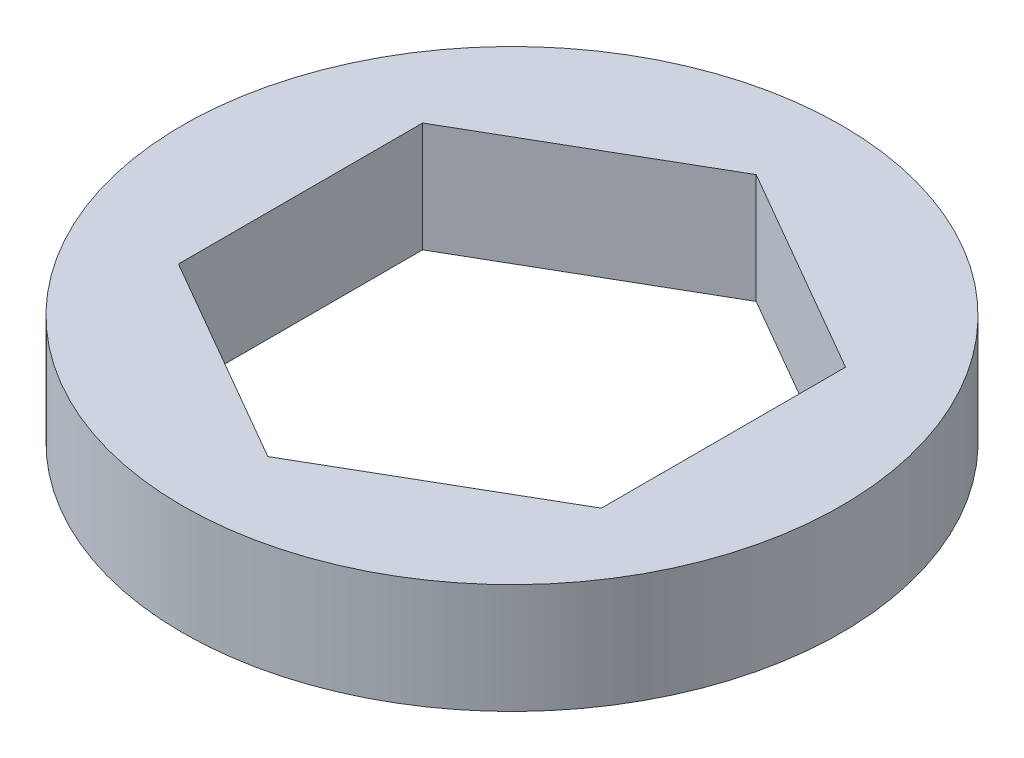
ISO-10303-21;
HEADER;
FILE_DESCRIPTION(('STEP AP214'),'2;1');
FILE_NAME('part.step','',(''),(''),'','','');
FILE_SCHEMA(('AUTOMOTIVE_DESIGN { 1 0 10303 214 1 1 1 1 }'));
ENDSEC;
DATA;
#1=APPLICATION_CONTEXT('core data for automotive mechanical design processes');
#2=APPLICATION_PROTOCOL_DEFINITION('international standard','automotive_design',2000,#1);
#3=PRODUCT_CONTEXT('',#1,'mechanical');
#4=PRODUCT('Part','Part','',(#3));
#5=PRODUCT_RELATED_PRODUCT_CATEGORY('part','',(#4));
#6=PRODUCT_DEFINITION_FORMATION('','',#4);
#7=PRODUCT_DEFINITION_CONTEXT('part definition',#1,'design');
#8=PRODUCT_DEFINITION('design','',#6,#7);
#9=PRODUCT_DEFINITION_SHAPE('','',#8);
#10=(LENGTH_UNIT() NAMED_UNIT(*) SI_UNIT(.MILLI.,.METRE.));
#11=(NAMED_UNIT(*) PLANE_ANGLE_UNIT() SI_UNIT($,.RADIAN.));
#12=(NAMED_UNIT(*) SI_UNIT($,.STERADIAN.) SOLID_ANGLE_UNIT());
#13=UNCERTAINTY_MEASURE_WITH_UNIT(LENGTH_MEASURE(1.E-05),#10,'distance_accuracy_value','');
#14=(GEOMETRIC_REPRESENTATION_CONTEXT(3) GLOBAL_UNCERTAINTY_ASSIGNED_CONTEXT((#13)) GLOBAL_UNIT_ASSIGNED_CONTEXT((#10,
#11,#12)) REPRESENTATION_CONTEXT('',''));
#15=CARTESIAN_POINT('',(0.,0.,0.));
#16=DIRECTION('',(0.,0.,1.));
#17=DIRECTION('',(1.,0.,0.));
#18=AXIS2_PLACEMENT_3D('',#15,#16,#17);
#19=CARTESIAN_POINT('',(0.,1.27,0.));
#20=DIRECTION('',(0.,1.,0.));
#21=DIRECTION('',(0.,0.,1.));
#22=AXIS2_PLACEMENT_3D('',#19,#20,#21);
#23=PLANE('',#22);
#24=CARTESIAN_POINT('',(0.,1.27,0.));
#25=DIRECTION('',(0.,1.,0.));
#26=DIRECTION('',(0.,0.,1.));
#27=AXIS2_PLACEMENT_3D('',#24,#25,#26);
#28=CIRCLE('',#27,7.62);
#29=CARTESIAN_POINT('',(0.,1.27,7.62));
#30=VERTEX_POINT('',#29);
#31=EDGE_CURVE('E11',#30,#30,#28,.T.);
#32=ORIENTED_EDGE('',*,*,#31,.T.);
#33=EDGE_LOOP('',(#32));
#34=FACE_BOUND('',#33,.T.);
#35=DIRECTION('',(0.,0.,-1.));
#36=VECTOR('',#35,1.);
#37=CARTESIAN_POINT('',(4.8895,1.27,2.82295414120268));
#38=LINE('',#37,#36);
#39=CARTESIAN_POINT('',(4.8895,1.27,2.82295414120268));
#40=VERTEX_POINT('',#39);
#41=CARTESIAN_POINT('',(4.8895,1.27,-2.82295414120268));
#42=VERTEX_POINT('',#41);
#43=EDGE_CURVE('E102',#40,#42,#38,.T.);
#44=ORIENTED_EDGE('',*,*,#43,.F.);
#45=DIRECTION('',(0.866025403784439,0.,-0.5));
#46=VECTOR('',#45,1.);
#47=CARTESIAN_POINT('',(0.,1.27,5.64590828240535));
#48=LINE('',#47,#46);
#49=CARTESIAN_POINT('',(0.,1.27,5.64590828240535));
#50=VERTEX_POINT('',#49);
#51=EDGE_CURVE('E93',#50,#40,#48,.T.);
#52=ORIENTED_EDGE('',*,*,#51,.F.);
#53=DIRECTION('',(0.866025403784439,0.,0.5));
#54=VECTOR('',#53,1.);
#55=CARTESIAN_POINT('',(-4.8895,1.27,2.82295414120267));
#56=LINE('',#55,#54);
#57=CARTESIAN_POINT('',(-4.8895,1.27,2.82295414120267));
#58=VERTEX_POINT('',#57);
#59=EDGE_CURVE('E127',#58,#50,#56,.T.);
#60=ORIENTED_EDGE('',*,*,#59,.F.);
#61=DIRECTION('',(0.,0.,1.));
#62=VECTOR('',#61,1.);
#63=CARTESIAN_POINT('',(-4.8895,1.27,-2.82295414120268));
#64=LINE('',#63,#62);
#65=CARTESIAN_POINT('',(-4.8895,1.27,-2.82295414120268));
#66=VERTEX_POINT('',#65);
#67=EDGE_CURVE('E124',#66,#58,#64,.T.);
#68=ORIENTED_EDGE('',*,*,#67,.F.);
#69=DIRECTION('',(-0.866025403784439,0.,0.5));
#70=VECTOR('',#69,1.);
#71=CARTESIAN_POINT('',(0.,1.27,-5.64590828240535));
#72=LINE('',#71,#70);
#73=CARTESIAN_POINT('',(0.,1.27,-5.64590828240535));
#74=VERTEX_POINT('',#73);
#75=EDGE_CURVE('E119',#74,#66,#72,.T.);
#76=ORIENTED_EDGE('',*,*,#75,.F.);
#77=DIRECTION('',(-0.866025403784439,0.,-0.5));
#78=VECTOR('',#77,1.);
#79=CARTESIAN_POINT('',(4.8895,1.27,-2.82295414120268));
#80=LINE('',#79,#78);
#81=EDGE_CURVE('E115',#42,#74,#80,.T.);
#82=ORIENTED_EDGE('',*,*,#81,.F.);
#83=EDGE_LOOP('',(#44,#52,#60,#68,#76,#82));
#84=FACE_BOUND('',#83,.T.);
#85=ADVANCED_FACE('F39',(#34,#84),#23,.T.);
#86=CARTESIAN_POINT('',(0.,-1.27,0.));
#87=DIRECTION('',(0.,1.,0.));
#88=DIRECTION('',(0.,0.,1.));
#89=AXIS2_PLACEMENT_3D('',#86,#87,#88);
#90=PLANE('',#89);
#91=CARTESIAN_POINT('',(0.,-1.27,0.));
#92=DIRECTION('',(0.,1.,0.));
#93=DIRECTION('',(0.,0.,1.));
#94=AXIS2_PLACEMENT_3D('',#91,#92,#93);
#95=CIRCLE('',#94,7.62);
#96=CARTESIAN_POINT('',(0.,-1.27,7.62));
#97=VERTEX_POINT('',#96);
#98=EDGE_CURVE('E43',#97,#97,#95,.T.);
#99=ORIENTED_EDGE('',*,*,#98,.F.);
#100=EDGE_LOOP('',(#99));
#101=FACE_BOUND('',#100,.T.);
#102=DIRECTION('',(0.866025403784439,0.,-0.5));
#103=VECTOR('',#102,1.);
#104=CARTESIAN_POINT('',(0.,-1.27,5.64590828240535));
#105=LINE('',#104,#103);
#106=CARTESIAN_POINT('',(0.,-1.27,5.64590828240535));
#107=VERTEX_POINT('',#106);
#108=CARTESIAN_POINT('',(4.8895,-1.27,2.82295414120268));
#109=VERTEX_POINT('',#108);
#110=EDGE_CURVE('E63',#107,#109,#105,.T.);
#111=ORIENTED_EDGE('',*,*,#110,.T.);
#112=DIRECTION('',(0.,0.,-1.));
#113=VECTOR('',#112,1.);
#114=CARTESIAN_POINT('',(4.8895,-1.27,2.82295414120268));
#115=LINE('',#114,#113);
#116=CARTESIAN_POINT('',(4.8895,-1.27,-2.82295414120268));
#117=VERTEX_POINT('',#116);
#118=EDGE_CURVE('E109',#109,#117,#115,.T.);
#119=ORIENTED_EDGE('',*,*,#118,.T.);
#120=DIRECTION('',(-0.866025403784439,0.,-0.5));
#121=VECTOR('',#120,1.);
#122=CARTESIAN_POINT('',(4.8895,-1.27,-2.82295414120268));
#123=LINE('',#122,#121);
#124=CARTESIAN_POINT('',(0.,-1.27,-5.64590828240535));
#125=VERTEX_POINT('',#124);
#126=EDGE_CURVE('E134',#117,#125,#123,.T.);
#127=ORIENTED_EDGE('',*,*,#126,.T.);
#128=DIRECTION('',(-0.866025403784439,0.,0.5));
#129=VECTOR('',#128,1.);
#130=CARTESIAN_POINT('',(0.,-1.27,-5.64590828240535));
#131=LINE('',#130,#129);
#132=CARTESIAN_POINT('',(-4.8895,-1.27,-2.82295414120268));
#133=VERTEX_POINT('',#132);
#134=EDGE_CURVE('E138',#125,#133,#131,.T.);
#135=ORIENTED_EDGE('',*,*,#134,.T.);
#136=DIRECTION('',(0.,0.,1.));
#137=VECTOR('',#136,1.);
#138=CARTESIAN_POINT('',(-4.8895,-1.27,-2.82295414120268));
#139=LINE('',#138,#137);
#140=CARTESIAN_POINT('',(-4.8895,-1.27,2.82295414120267));
#141=VERTEX_POINT('',#140);
#142=EDGE_CURVE('E142',#133,#141,#139,.T.);
#143=ORIENTED_EDGE('',*,*,#142,.T.);
#144=DIRECTION('',(0.866025403784439,0.,0.5));
#145=VECTOR('',#144,1.);
#146=CARTESIAN_POINT('',(-4.8895,-1.27,2.82295414120267));
#147=LINE('',#146,#145);
#148=EDGE_CURVE('E103',#141,#107,#147,.T.);
#149=ORIENTED_EDGE('',*,*,#148,.T.);
#150=EDGE_LOOP('',(#111,#119,#127,#135,#143,#149));
#151=FACE_BOUND('',#150,.T.);
#152=ADVANCED_FACE('F166',(#101,#151),#90,.F.);
#153=CARTESIAN_POINT('',(0.,1.27,0.));
#154=DIRECTION('',(0.,-1.,0.));
#155=DIRECTION('',(0.,0.,-1.));
#156=AXIS2_PLACEMENT_3D('',#153,#154,#155);
#157=CYLINDRICAL_SURFACE('',#156,7.62);
#158=ORIENTED_EDGE('',*,*,#31,.F.);
#159=EDGE_LOOP('',(#158));
#160=FACE_BOUND('',#159,.T.);
#161=ORIENTED_EDGE('',*,*,#98,.T.);
#162=EDGE_LOOP('',(#161));
#163=FACE_BOUND('',#162,.T.);
#164=ADVANCED_FACE('F41',(#160,#163),#157,.T.);
#165=CARTESIAN_POINT('',(0.,1.27,5.64590828240535));
#166=DIRECTION('',(-0.5,0.,-0.866025403784439));
#167=DIRECTION('',(-0.866025403784439,0.,0.5));
#168=AXIS2_PLACEMENT_3D('',#165,#166,#167);
#169=PLANE('',#168);
#170=ORIENTED_EDGE('',*,*,#110,.F.);
#171=DIRECTION('',(0.,-1.,0.));
#172=VECTOR('',#171,1.);
#173=CARTESIAN_POINT('',(0.,1.27,5.64590828240535));
#174=LINE('',#173,#172);
#175=EDGE_CURVE('E97',#50,#107,#174,.T.);
#176=ORIENTED_EDGE('',*,*,#175,.F.);
#177=ORIENTED_EDGE('',*,*,#51,.T.);
#178=DIRECTION('',(0.,-1.,0.));
#179=VECTOR('',#178,1.);
#180=CARTESIAN_POINT('',(4.8895,1.27,2.82295414120268));
#181=LINE('',#180,#179);
#182=EDGE_CURVE('E96',#40,#109,#181,.T.);
#183=ORIENTED_EDGE('',*,*,#182,.T.);
#184=EDGE_LOOP('',(#170,#176,#177,#183));
#185=FACE_BOUND('',#184,.T.);
#186=ADVANCED_FACE('F95',(#185),#169,.T.);
#187=CARTESIAN_POINT('',(4.8895,1.27,2.82295414120268));
#188=DIRECTION('',(-1.,0.,0.));
#189=DIRECTION('',(0.,0.,1.));
#190=AXIS2_PLACEMENT_3D('',#187,#188,#189);
#191=PLANE('',#190);
#192=ORIENTED_EDGE('',*,*,#118,.F.);
#193=ORIENTED_EDGE('',*,*,#182,.F.);
#194=ORIENTED_EDGE('',*,*,#43,.T.);
#195=DIRECTION('',(0.,-1.,0.));
#196=VECTOR('',#195,1.);
#197=CARTESIAN_POINT('',(4.8895,1.27,-2.82295414120268));
#198=LINE('',#197,#196);
#199=EDGE_CURVE('E111',#42,#117,#198,.T.);
#200=ORIENTED_EDGE('',*,*,#199,.T.);
#201=EDGE_LOOP('',(#192,#193,#194,#200));
#202=FACE_BOUND('',#201,.T.);
#203=ADVANCED_FACE('F106',(#202),#191,.T.);
#204=CARTESIAN_POINT('',(4.8895,1.27,-2.82295414120268));
#205=DIRECTION('',(-0.5,0.,0.866025403784439));
#206=DIRECTION('',(0.866025403784439,0.,0.5));
#207=AXIS2_PLACEMENT_3D('',#204,#205,#206);
#208=PLANE('',#207);
#209=ORIENTED_EDGE('',*,*,#126,.F.);
#210=ORIENTED_EDGE('',*,*,#199,.F.);
#211=ORIENTED_EDGE('',*,*,#81,.T.);
#212=DIRECTION('',(0.,-1.,0.));
#213=VECTOR('',#212,1.);
#214=CARTESIAN_POINT('',(0.,1.27,-5.64590828240535));
#215=LINE('',#214,#213);
#216=EDGE_CURVE('E156',#74,#125,#215,.T.);
#217=ORIENTED_EDGE('',*,*,#216,.T.);
#218=EDGE_LOOP('',(#209,#210,#211,#217));
#219=FACE_BOUND('',#218,.T.);
#220=ADVANCED_FACE('F162',(#219),#208,.T.);
#221=CARTESIAN_POINT('',(0.,1.27,-5.64590828240535));
#222=DIRECTION('',(0.5,0.,0.866025403784439));
#223=DIRECTION('',(0.866025403784439,0.,-0.5));
#224=AXIS2_PLACEMENT_3D('',#221,#222,#223);
#225=PLANE('',#224);
#226=ORIENTED_EDGE('',*,*,#134,.F.);
#227=ORIENTED_EDGE('',*,*,#216,.F.);
#228=ORIENTED_EDGE('',*,*,#75,.T.);
#229=DIRECTION('',(0.,-1.,0.));
#230=VECTOR('',#229,1.);
#231=CARTESIAN_POINT('',(-4.8895,1.27,-2.82295414120268));
#232=LINE('',#231,#230);
#233=EDGE_CURVE('E153',#66,#133,#232,.T.);
#234=ORIENTED_EDGE('',*,*,#233,.T.);
#235=EDGE_LOOP('',(#226,#227,#228,#234));
#236=FACE_BOUND('',#235,.T.);
#237=ADVANCED_FACE('F174',(#236),#225,.T.);
#238=CARTESIAN_POINT('',(-4.8895,1.27,-2.82295414120268));
#239=DIRECTION('',(1.,0.,0.));
#240=DIRECTION('',(0.,0.,-1.));
#241=AXIS2_PLACEMENT_3D('',#238,#239,#240);
#242=PLANE('',#241);
#243=ORIENTED_EDGE('',*,*,#142,.F.);
#244=ORIENTED_EDGE('',*,*,#233,.F.);
#245=ORIENTED_EDGE('',*,*,#67,.T.);
#246=DIRECTION('',(0.,-1.,0.));
#247=VECTOR('',#246,1.);
#248=CARTESIAN_POINT('',(-4.8895,1.27,2.82295414120267));
#249=LINE('',#248,#247);
#250=EDGE_CURVE('E55',#58,#141,#249,.T.);
#251=ORIENTED_EDGE('',*,*,#250,.T.);
#252=EDGE_LOOP('',(#243,#244,#245,#251));
#253=FACE_BOUND('',#252,.T.);
#254=ADVANCED_FACE('F172',(#253),#242,.T.);
#255=CARTESIAN_POINT('',(-4.8895,1.27,2.82295414120267));
#256=DIRECTION('',(0.5,0.,-0.866025403784439));
#257=DIRECTION('',(-0.866025403784439,0.,-0.5));
#258=AXIS2_PLACEMENT_3D('',#255,#256,#257);
#259=PLANE('',#258);
#260=ORIENTED_EDGE('',*,*,#148,.F.);
#261=ORIENTED_EDGE('',*,*,#250,.F.);
#262=ORIENTED_EDGE('',*,*,#59,.T.);
#263=ORIENTED_EDGE('',*,*,#175,.T.);
#264=EDGE_LOOP('',(#260,#261,#262,#263));
#265=FACE_BOUND('',#264,.T.);
#266=ADVANCED_FACE('F168',(#265),#259,.T.);
#267=CLOSED_SHELL('',(#85,#152,#164,#186,#203,#220,#237,#254,#266));
#268=MANIFOLD_SOLID_BREP('B2',#267);
#269=ADVANCED_BREP_SHAPE_REPRESENTATION('',(#18,#268),#14);
#270=SHAPE_DEFINITION_REPRESENTATION(#9,#269);
ENDSEC;
END-ISO-10303-21;
